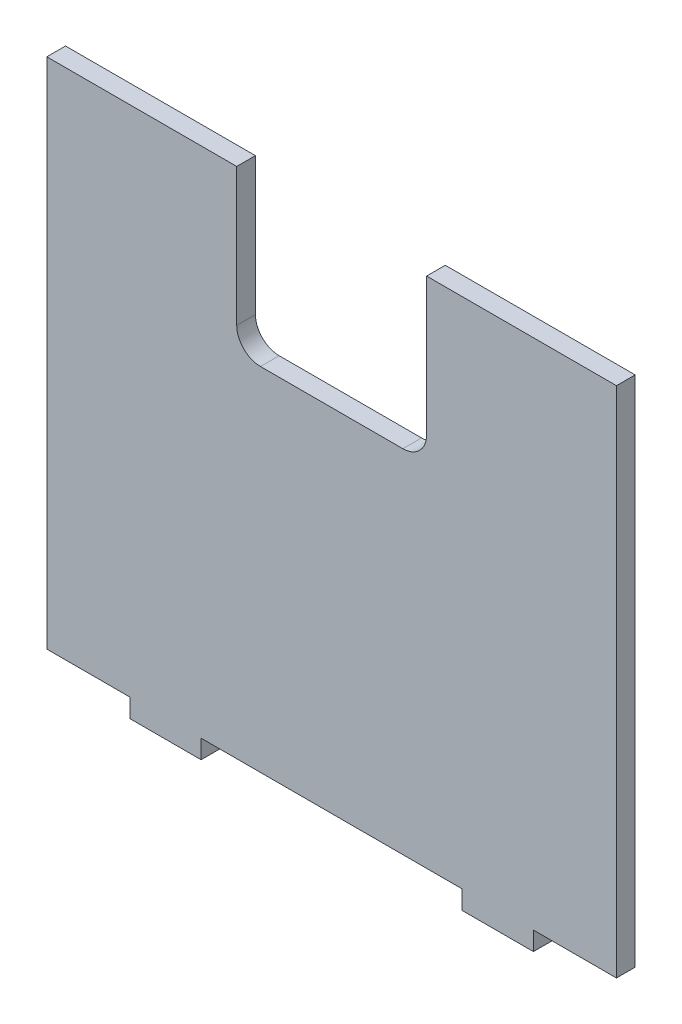
ISO-10303-21;
HEADER;
FILE_DESCRIPTION(('STEP AP214'),'2;1');
FILE_NAME('part.step','',(''),(''),'','','');
FILE_SCHEMA(('AUTOMOTIVE_DESIGN { 1 0 10303 214 1 1 1 1 }'));
ENDSEC;
DATA;
#1=APPLICATION_CONTEXT('core data for automotive mechanical design processes');
#2=APPLICATION_PROTOCOL_DEFINITION('international standard','automotive_design',2000,#1);
#3=PRODUCT_CONTEXT('',#1,'mechanical');
#4=PRODUCT('Part','Part','',(#3));
#5=PRODUCT_RELATED_PRODUCT_CATEGORY('part','',(#4));
#6=PRODUCT_DEFINITION_FORMATION('','',#4);
#7=PRODUCT_DEFINITION_CONTEXT('part definition',#1,'design');
#8=PRODUCT_DEFINITION('design','',#6,#7);
#9=PRODUCT_DEFINITION_SHAPE('','',#8);
#10=(LENGTH_UNIT() NAMED_UNIT(*) SI_UNIT(.MILLI.,.METRE.));
#11=(NAMED_UNIT(*) PLANE_ANGLE_UNIT() SI_UNIT($,.RADIAN.));
#12=(NAMED_UNIT(*) SI_UNIT($,.STERADIAN.) SOLID_ANGLE_UNIT());
#13=UNCERTAINTY_MEASURE_WITH_UNIT(LENGTH_MEASURE(1.E-05),#10,'distance_accuracy_value','');
#14=(GEOMETRIC_REPRESENTATION_CONTEXT(3) GLOBAL_UNCERTAINTY_ASSIGNED_CONTEXT((#13)) GLOBAL_UNIT_ASSIGNED_CONTEXT((#10,
#11,#12)) REPRESENTATION_CONTEXT('',''));
#15=CARTESIAN_POINT('',(0.,0.,0.));
#16=DIRECTION('',(0.,0.,1.));
#17=DIRECTION('',(1.,0.,0.));
#18=AXIS2_PLACEMENT_3D('',#15,#16,#17);
#19=CARTESIAN_POINT('',(-76.2,5.,0.));
#20=DIRECTION('',(0.,0.,1.));
#21=DIRECTION('',(1.,0.,0.));
#22=AXIS2_PLACEMENT_3D('',#19,#20,#21);
#23=PLANE('',#22);
#24=DIRECTION('',(1.,0.,0.));
#25=VECTOR('',#24,1.);
#26=CARTESIAN_POINT('',(-25.3999999999998,99.06,0.));
#27=LINE('',#26,#25);
#28=CARTESIAN_POINT('',(19.0500000000001,99.06,0.));
#29=VERTEX_POINT('',#28);
#30=CARTESIAN_POINT('',(-19.0499999999998,99.06,0.));
#31=VERTEX_POINT('',#30);
#32=EDGE_CURVE('E139',#29,#31,#27,.F.);
#33=ORIENTED_EDGE('',*,*,#32,.T.);
#34=CARTESIAN_POINT('',(-19.0499999999998,105.41,0.));
#35=DIRECTION('',(0.,0.,-1.));
#36=DIRECTION('',(-1.,0.,0.));
#37=AXIS2_PLACEMENT_3D('',#34,#35,#36);
#38=CIRCLE('',#37,6.35);
#39=CARTESIAN_POINT('',(-25.3999999999998,105.41,0.));
#40=VERTEX_POINT('',#39);
#41=EDGE_CURVE('E341',#31,#40,#38,.T.);
#42=ORIENTED_EDGE('',*,*,#41,.T.);
#43=DIRECTION('',(0.,-1.,0.));
#44=VECTOR('',#43,1.);
#45=CARTESIAN_POINT('',(-25.3999999999998,142.24,0.));
#46=LINE('',#45,#44);
#47=CARTESIAN_POINT('',(-25.3999999999998,142.24,0.));
#48=VERTEX_POINT('',#47);
#49=EDGE_CURVE('E296',#40,#48,#46,.F.);
#50=ORIENTED_EDGE('',*,*,#49,.T.);
#51=DIRECTION('',(1.,0.,0.));
#52=VECTOR('',#51,1.);
#53=CARTESIAN_POINT('',(-76.2000000000001,142.24,0.));
#54=LINE('',#53,#52);
#55=CARTESIAN_POINT('',(-76.2000000000001,142.24,0.));
#56=VERTEX_POINT('',#55);
#57=EDGE_CURVE('E281',#56,#48,#54,.T.);
#58=ORIENTED_EDGE('',*,*,#57,.F.);
#59=DIRECTION('',(0.,-1.,0.));
#60=VECTOR('',#59,1.);
#61=CARTESIAN_POINT('',(-76.2000000000001,142.24,0.));
#62=LINE('',#61,#60);
#63=CARTESIAN_POINT('',(-76.2,5.,0.));
#64=VERTEX_POINT('',#63);
#65=EDGE_CURVE('E289',#64,#56,#62,.F.);
#66=ORIENTED_EDGE('',*,*,#65,.F.);
#67=DIRECTION('',(1.,0.,0.));
#68=VECTOR('',#67,1.);
#69=CARTESIAN_POINT('',(-76.2,5.,0.));
#70=LINE('',#69,#68);
#71=CARTESIAN_POINT('',(-53.9750000000001,5.,0.));
#72=VERTEX_POINT('',#71);
#73=EDGE_CURVE('E276',#72,#64,#70,.F.);
#74=ORIENTED_EDGE('',*,*,#73,.F.);
#75=DIRECTION('',(0.,1.,0.));
#76=VECTOR('',#75,1.);
#77=CARTESIAN_POINT('',(-53.9750000000001,0.,0.));
#78=LINE('',#77,#76);
#79=CARTESIAN_POINT('',(-53.9750000000001,0.,0.));
#80=VERTEX_POINT('',#79);
#81=EDGE_CURVE('E266',#80,#72,#78,.T.);
#82=ORIENTED_EDGE('',*,*,#81,.F.);
#83=DIRECTION('',(1.,0.,0.));
#84=VECTOR('',#83,1.);
#85=CARTESIAN_POINT('',(-34.9250000000001,0.,0.));
#86=LINE('',#85,#84);
#87=CARTESIAN_POINT('',(-34.9250000000001,0.,0.));
#88=VERTEX_POINT('',#87);
#89=EDGE_CURVE('E256',#88,#80,#86,.F.);
#90=ORIENTED_EDGE('',*,*,#89,.F.);
#91=DIRECTION('',(0.,1.,0.));
#92=VECTOR('',#91,1.);
#93=CARTESIAN_POINT('',(-34.9250000000001,0.,0.));
#94=LINE('',#93,#92);
#95=CARTESIAN_POINT('',(-34.9250000000001,5.,0.));
#96=VERTEX_POINT('',#95);
#97=EDGE_CURVE('E246',#96,#88,#94,.F.);
#98=ORIENTED_EDGE('',*,*,#97,.F.);
#99=DIRECTION('',(1.,0.,0.));
#100=VECTOR('',#99,1.);
#101=CARTESIAN_POINT('',(-34.9250000000001,5.,0.));
#102=LINE('',#101,#100);
#103=CARTESIAN_POINT('',(34.9249999999999,5.,0.));
#104=VERTEX_POINT('',#103);
#105=EDGE_CURVE('E236',#104,#96,#102,.F.);
#106=ORIENTED_EDGE('',*,*,#105,.F.);
#107=DIRECTION('',(0.,1.,0.));
#108=VECTOR('',#107,1.);
#109=CARTESIAN_POINT('',(34.9249999999999,0.,0.));
#110=LINE('',#109,#108);
#111=CARTESIAN_POINT('',(34.9249999999999,0.,0.));
#112=VERTEX_POINT('',#111);
#113=EDGE_CURVE('E226',#112,#104,#110,.T.);
#114=ORIENTED_EDGE('',*,*,#113,.F.);
#115=DIRECTION('',(1.,0.,0.));
#116=VECTOR('',#115,1.);
#117=CARTESIAN_POINT('',(53.975,0.,0.));
#118=LINE('',#117,#116);
#119=CARTESIAN_POINT('',(53.975,0.,0.));
#120=VERTEX_POINT('',#119);
#121=EDGE_CURVE('E216',#120,#112,#118,.F.);
#122=ORIENTED_EDGE('',*,*,#121,.F.);
#123=DIRECTION('',(0.,1.,0.));
#124=VECTOR('',#123,1.);
#125=CARTESIAN_POINT('',(53.975,0.,0.));
#126=LINE('',#125,#124);
#127=CARTESIAN_POINT('',(53.975,5.,0.));
#128=VERTEX_POINT('',#127);
#129=EDGE_CURVE('E206',#128,#120,#126,.F.);
#130=ORIENTED_EDGE('',*,*,#129,.F.);
#131=DIRECTION('',(1.,0.,0.));
#132=VECTOR('',#131,1.);
#133=CARTESIAN_POINT('',(53.975,5.,0.));
#134=LINE('',#133,#132);
#135=CARTESIAN_POINT('',(76.1999999999999,5.,0.));
#136=VERTEX_POINT('',#135);
#137=EDGE_CURVE('E196',#136,#128,#134,.F.);
#138=ORIENTED_EDGE('',*,*,#137,.F.);
#139=DIRECTION('',(0.,1.,0.));
#140=VECTOR('',#139,1.);
#141=CARTESIAN_POINT('',(76.1999999999999,142.24,0.));
#142=LINE('',#141,#140);
#143=CARTESIAN_POINT('',(76.1999999999999,142.24,0.));
#144=VERTEX_POINT('',#143);
#145=EDGE_CURVE('E186',#144,#136,#142,.F.);
#146=ORIENTED_EDGE('',*,*,#145,.F.);
#147=DIRECTION('',(1.,0.,0.));
#148=VECTOR('',#147,1.);
#149=CARTESIAN_POINT('',(-76.2000000000001,142.24,0.));
#150=LINE('',#149,#148);
#151=CARTESIAN_POINT('',(25.3999999999998,142.24,0.));
#152=VERTEX_POINT('',#151);
#153=EDGE_CURVE('E176',#152,#144,#150,.T.);
#154=ORIENTED_EDGE('',*,*,#153,.F.);
#155=DIRECTION('',(0.,1.,0.));
#156=VECTOR('',#155,1.);
#157=CARTESIAN_POINT('',(25.3999999999998,142.24,0.));
#158=LINE('',#157,#156);
#159=CARTESIAN_POINT('',(25.4000000000001,105.41,0.));
#160=VERTEX_POINT('',#159);
#161=EDGE_CURVE('E136',#152,#160,#158,.F.);
#162=ORIENTED_EDGE('',*,*,#161,.T.);
#163=CARTESIAN_POINT('',(19.0500000000001,105.41,0.));
#164=DIRECTION('',(0.,0.,-1.));
#165=DIRECTION('',(-1.,0.,0.));
#166=AXIS2_PLACEMENT_3D('',#163,#164,#165);
#167=CIRCLE('',#166,6.35);
#168=EDGE_CURVE('E18',#160,#29,#167,.T.);
#169=ORIENTED_EDGE('',*,*,#168,.T.);
#170=EDGE_LOOP('',(#33,#42,#50,#58,#66,#74,#82,#90,#98,#106,#114,#122,#130,#138,#146,#154,#162,#169));
#171=FACE_BOUND('',#170,.T.);
#172=ADVANCED_FACE('F15',(#171),#23,.T.);
#173=CARTESIAN_POINT('',(-76.2000000000001,142.24,-5.));
#174=DIRECTION('',(-1.,0.,0.));
#175=DIRECTION('',(0.,-1.,0.));
#176=AXIS2_PLACEMENT_3D('',#173,#174,#175);
#177=PLANE('',#176);
#178=DIRECTION('',(0.,1.,0.));
#179=VECTOR('',#178,1.);
#180=CARTESIAN_POINT('',(-76.2000000000001,5.,-5.));
#181=LINE('',#180,#179);
#182=CARTESIAN_POINT('',(-76.2000000000001,142.24,-5.));
#183=VERTEX_POINT('',#182);
#184=CARTESIAN_POINT('',(-76.2,5.,-5.));
#185=VERTEX_POINT('',#184);
#186=EDGE_CURVE('E271',#183,#185,#181,.F.);
#187=ORIENTED_EDGE('',*,*,#186,.T.);
#188=DIRECTION('',(0.,0.,-1.));
#189=VECTOR('',#188,1.);
#190=CARTESIAN_POINT('',(-76.2,5.,-5.));
#191=LINE('',#190,#189);
#192=EDGE_CURVE('E274',#64,#185,#191,.T.);
#193=ORIENTED_EDGE('',*,*,#192,.F.);
#194=ORIENTED_EDGE('',*,*,#65,.T.);
#195=DIRECTION('',(0.,0.,1.));
#196=VECTOR('',#195,1.);
#197=CARTESIAN_POINT('',(-76.2000000000001,142.24,-5.));
#198=LINE('',#197,#196);
#199=EDGE_CURVE('E284',#183,#56,#198,.T.);
#200=ORIENTED_EDGE('',*,*,#199,.F.);
#201=EDGE_LOOP('',(#187,#193,#194,#200));
#202=FACE_BOUND('',#201,.T.);
#203=ADVANCED_FACE('F396',(#202),#177,.T.);
#204=CARTESIAN_POINT('',(-76.2,5.,-5.));
#205=DIRECTION('',(0.,-1.,0.));
#206=DIRECTION('',(0.,0.,-1.));
#207=AXIS2_PLACEMENT_3D('',#204,#205,#206);
#208=PLANE('',#207);
#209=DIRECTION('',(1.,0.,0.));
#210=VECTOR('',#209,1.);
#211=CARTESIAN_POINT('',(-76.2,5.,-5.));
#212=LINE('',#211,#210);
#213=CARTESIAN_POINT('',(-53.9750000000001,5.,-5.));
#214=VERTEX_POINT('',#213);
#215=EDGE_CURVE('E261',#185,#214,#212,.T.);
#216=ORIENTED_EDGE('',*,*,#215,.T.);
#217=DIRECTION('',(0.,0.,1.));
#218=VECTOR('',#217,1.);
#219=CARTESIAN_POINT('',(-53.9750000000001,5.,-5.));
#220=LINE('',#219,#218);
#221=EDGE_CURVE('E264',#72,#214,#220,.F.);
#222=ORIENTED_EDGE('',*,*,#221,.F.);
#223=ORIENTED_EDGE('',*,*,#73,.T.);
#224=ORIENTED_EDGE('',*,*,#192,.T.);
#225=EDGE_LOOP('',(#216,#222,#223,#224));
#226=FACE_BOUND('',#225,.T.);
#227=ADVANCED_FACE('F399',(#226),#208,.T.);
#228=CARTESIAN_POINT('',(-53.9750000000001,0.,-5.));
#229=DIRECTION('',(-1.,0.,0.));
#230=DIRECTION('',(0.,0.,1.));
#231=AXIS2_PLACEMENT_3D('',#228,#229,#230);
#232=PLANE('',#231);
#233=DIRECTION('',(0.,1.,0.));
#234=VECTOR('',#233,1.);
#235=CARTESIAN_POINT('',(-53.9750000000001,5.,-5.));
#236=LINE('',#235,#234);
#237=CARTESIAN_POINT('',(-53.9750000000001,0.,-5.));
#238=VERTEX_POINT('',#237);
#239=EDGE_CURVE('E251',#214,#238,#236,.F.);
#240=ORIENTED_EDGE('',*,*,#239,.T.);
#241=DIRECTION('',(0.,0.,-1.));
#242=VECTOR('',#241,1.);
#243=CARTESIAN_POINT('',(-53.9750000000001,0.,-5.));
#244=LINE('',#243,#242);
#245=EDGE_CURVE('E254',#80,#238,#244,.T.);
#246=ORIENTED_EDGE('',*,*,#245,.F.);
#247=ORIENTED_EDGE('',*,*,#81,.T.);
#248=ORIENTED_EDGE('',*,*,#221,.T.);
#249=EDGE_LOOP('',(#240,#246,#247,#248));
#250=FACE_BOUND('',#249,.T.);
#251=ADVANCED_FACE('F405',(#250),#232,.T.);
#252=CARTESIAN_POINT('',(-34.9250000000001,0.,-5.));
#253=DIRECTION('',(0.,-1.,0.));
#254=DIRECTION('',(0.,0.,-1.));
#255=AXIS2_PLACEMENT_3D('',#252,#253,#254);
#256=PLANE('',#255);
#257=DIRECTION('',(1.,0.,0.));
#258=VECTOR('',#257,1.);
#259=CARTESIAN_POINT('',(-76.2,0.,-5.));
#260=LINE('',#259,#258);
#261=CARTESIAN_POINT('',(-34.9250000000001,0.,-5.));
#262=VERTEX_POINT('',#261);
#263=EDGE_CURVE('E241',#238,#262,#260,.T.);
#264=ORIENTED_EDGE('',*,*,#263,.T.);
#265=DIRECTION('',(0.,0.,-1.));
#266=VECTOR('',#265,1.);
#267=CARTESIAN_POINT('',(-34.9250000000001,0.,-5.));
#268=LINE('',#267,#266);
#269=EDGE_CURVE('E244',#88,#262,#268,.T.);
#270=ORIENTED_EDGE('',*,*,#269,.F.);
#271=ORIENTED_EDGE('',*,*,#89,.T.);
#272=ORIENTED_EDGE('',*,*,#245,.T.);
#273=EDGE_LOOP('',(#264,#270,#271,#272));
#274=FACE_BOUND('',#273,.T.);
#275=ADVANCED_FACE('F412',(#274),#256,.T.);
#276=CARTESIAN_POINT('',(-34.9250000000001,0.,-5.));
#277=DIRECTION('',(1.,0.,0.));
#278=DIRECTION('',(0.,0.,-1.));
#279=AXIS2_PLACEMENT_3D('',#276,#277,#278);
#280=PLANE('',#279);
#281=DIRECTION('',(0.,1.,0.));
#282=VECTOR('',#281,1.);
#283=CARTESIAN_POINT('',(-34.9250000000001,5.,-5.));
#284=LINE('',#283,#282);
#285=CARTESIAN_POINT('',(-34.9250000000001,5.,-5.));
#286=VERTEX_POINT('',#285);
#287=EDGE_CURVE('E231',#262,#286,#284,.T.);
#288=ORIENTED_EDGE('',*,*,#287,.T.);
#289=DIRECTION('',(0.,0.,-1.));
#290=VECTOR('',#289,1.);
#291=CARTESIAN_POINT('',(-34.9250000000001,5.,-5.));
#292=LINE('',#291,#290);
#293=EDGE_CURVE('E234',#96,#286,#292,.T.);
#294=ORIENTED_EDGE('',*,*,#293,.F.);
#295=ORIENTED_EDGE('',*,*,#97,.T.);
#296=ORIENTED_EDGE('',*,*,#269,.T.);
#297=EDGE_LOOP('',(#288,#294,#295,#296));
#298=FACE_BOUND('',#297,.T.);
#299=ADVANCED_FACE('F414',(#298),#280,.T.);
#300=CARTESIAN_POINT('',(-34.9250000000001,5.,-5.));
#301=DIRECTION('',(0.,-1.,0.));
#302=DIRECTION('',(0.,0.,-1.));
#303=AXIS2_PLACEMENT_3D('',#300,#301,#302);
#304=PLANE('',#303);
#305=DIRECTION('',(1.,0.,0.));
#306=VECTOR('',#305,1.);
#307=CARTESIAN_POINT('',(-76.2,5.,-5.));
#308=LINE('',#307,#306);
#309=CARTESIAN_POINT('',(34.9249999999999,5.,-5.));
#310=VERTEX_POINT('',#309);
#311=EDGE_CURVE('E221',#286,#310,#308,.T.);
#312=ORIENTED_EDGE('',*,*,#311,.T.);
#313=DIRECTION('',(0.,0.,1.));
#314=VECTOR('',#313,1.);
#315=CARTESIAN_POINT('',(34.9249999999999,5.,-5.));
#316=LINE('',#315,#314);
#317=EDGE_CURVE('E224',#104,#310,#316,.F.);
#318=ORIENTED_EDGE('',*,*,#317,.F.);
#319=ORIENTED_EDGE('',*,*,#105,.T.);
#320=ORIENTED_EDGE('',*,*,#293,.T.);
#321=EDGE_LOOP('',(#312,#318,#319,#320));
#322=FACE_BOUND('',#321,.T.);
#323=ADVANCED_FACE('F420',(#322),#304,.T.);
#324=CARTESIAN_POINT('',(34.9249999999999,0.,-5.));
#325=DIRECTION('',(-1.,0.,0.));
#326=DIRECTION('',(0.,0.,1.));
#327=AXIS2_PLACEMENT_3D('',#324,#325,#326);
#328=PLANE('',#327);
#329=DIRECTION('',(0.,1.,0.));
#330=VECTOR('',#329,1.);
#331=CARTESIAN_POINT('',(34.9249999999999,5.,-5.));
#332=LINE('',#331,#330);
#333=CARTESIAN_POINT('',(34.9249999999999,0.,-5.));
#334=VERTEX_POINT('',#333);
#335=EDGE_CURVE('E211',#310,#334,#332,.F.);
#336=ORIENTED_EDGE('',*,*,#335,.T.);
#337=DIRECTION('',(0.,0.,-1.));
#338=VECTOR('',#337,1.);
#339=CARTESIAN_POINT('',(34.9249999999999,0.,-5.));
#340=LINE('',#339,#338);
#341=EDGE_CURVE('E214',#112,#334,#340,.T.);
#342=ORIENTED_EDGE('',*,*,#341,.F.);
#343=ORIENTED_EDGE('',*,*,#113,.T.);
#344=ORIENTED_EDGE('',*,*,#317,.T.);
#345=EDGE_LOOP('',(#336,#342,#343,#344));
#346=FACE_BOUND('',#345,.T.);
#347=ADVANCED_FACE('F427',(#346),#328,.T.);
#348=CARTESIAN_POINT('',(53.975,0.,-5.));
#349=DIRECTION('',(0.,-1.,0.));
#350=DIRECTION('',(0.,0.,-1.));
#351=AXIS2_PLACEMENT_3D('',#348,#349,#350);
#352=PLANE('',#351);
#353=DIRECTION('',(1.,0.,0.));
#354=VECTOR('',#353,1.);
#355=CARTESIAN_POINT('',(-76.2,0.,-5.));
#356=LINE('',#355,#354);
#357=CARTESIAN_POINT('',(53.9749999999999,0.,-5.));
#358=VERTEX_POINT('',#357);
#359=EDGE_CURVE('E201',#334,#358,#356,.T.);
#360=ORIENTED_EDGE('',*,*,#359,.T.);
#361=DIRECTION('',(0.,0.,-1.));
#362=VECTOR('',#361,1.);
#363=CARTESIAN_POINT('',(53.975,0.,-5.));
#364=LINE('',#363,#362);
#365=EDGE_CURVE('E204',#120,#358,#364,.T.);
#366=ORIENTED_EDGE('',*,*,#365,.F.);
#367=ORIENTED_EDGE('',*,*,#121,.T.);
#368=ORIENTED_EDGE('',*,*,#341,.T.);
#369=EDGE_LOOP('',(#360,#366,#367,#368));
#370=FACE_BOUND('',#369,.T.);
#371=ADVANCED_FACE('F429',(#370),#352,.T.);
#372=CARTESIAN_POINT('',(53.975,0.,-5.));
#373=DIRECTION('',(1.,0.,0.));
#374=DIRECTION('',(0.,0.,-1.));
#375=AXIS2_PLACEMENT_3D('',#372,#373,#374);
#376=PLANE('',#375);
#377=DIRECTION('',(0.,1.,0.));
#378=VECTOR('',#377,1.);
#379=CARTESIAN_POINT('',(53.9749999999999,5.,-5.));
#380=LINE('',#379,#378);
#381=CARTESIAN_POINT('',(53.9749999999999,5.,-5.));
#382=VERTEX_POINT('',#381);
#383=EDGE_CURVE('E191',#358,#382,#380,.T.);
#384=ORIENTED_EDGE('',*,*,#383,.T.);
#385=DIRECTION('',(0.,0.,-1.));
#386=VECTOR('',#385,1.);
#387=CARTESIAN_POINT('',(53.975,5.,-5.));
#388=LINE('',#387,#386);
#389=EDGE_CURVE('E194',#128,#382,#388,.T.);
#390=ORIENTED_EDGE('',*,*,#389,.F.);
#391=ORIENTED_EDGE('',*,*,#129,.T.);
#392=ORIENTED_EDGE('',*,*,#365,.T.);
#393=EDGE_LOOP('',(#384,#390,#391,#392));
#394=FACE_BOUND('',#393,.T.);
#395=ADVANCED_FACE('F435',(#394),#376,.T.);
#396=CARTESIAN_POINT('',(53.975,5.,-5.));
#397=DIRECTION('',(0.,-1.,0.));
#398=DIRECTION('',(0.,0.,-1.));
#399=AXIS2_PLACEMENT_3D('',#396,#397,#398);
#400=PLANE('',#399);
#401=DIRECTION('',(1.,0.,0.));
#402=VECTOR('',#401,1.);
#403=CARTESIAN_POINT('',(-76.2,5.,-5.));
#404=LINE('',#403,#402);
#405=CARTESIAN_POINT('',(76.1999999999999,5.,-5.));
#406=VERTEX_POINT('',#405);
#407=EDGE_CURVE('E181',#382,#406,#404,.T.);
#408=ORIENTED_EDGE('',*,*,#407,.T.);
#409=DIRECTION('',(0.,0.,1.));
#410=VECTOR('',#409,1.);
#411=CARTESIAN_POINT('',(76.1999999999999,5.,-5.));
#412=LINE('',#411,#410);
#413=EDGE_CURVE('E184',#136,#406,#412,.F.);
#414=ORIENTED_EDGE('',*,*,#413,.F.);
#415=ORIENTED_EDGE('',*,*,#137,.T.);
#416=ORIENTED_EDGE('',*,*,#389,.T.);
#417=EDGE_LOOP('',(#408,#414,#415,#416));
#418=FACE_BOUND('',#417,.T.);
#419=ADVANCED_FACE('F441',(#418),#400,.T.);
#420=CARTESIAN_POINT('',(76.1999999999999,142.24,-5.));
#421=DIRECTION('',(1.,0.,0.));
#422=DIRECTION('',(0.,1.,0.));
#423=AXIS2_PLACEMENT_3D('',#420,#421,#422);
#424=PLANE('',#423);
#425=DIRECTION('',(0.,1.,0.));
#426=VECTOR('',#425,1.);
#427=CARTESIAN_POINT('',(76.1999999999999,5.,-5.));
#428=LINE('',#427,#426);
#429=CARTESIAN_POINT('',(76.1999999999999,142.24,-5.));
#430=VERTEX_POINT('',#429);
#431=EDGE_CURVE('E172',#406,#430,#428,.T.);
#432=ORIENTED_EDGE('',*,*,#431,.T.);
#433=DIRECTION('',(0.,0.,1.));
#434=VECTOR('',#433,1.);
#435=CARTESIAN_POINT('',(76.1999999999999,142.24,-5.));
#436=LINE('',#435,#434);
#437=EDGE_CURVE('E165',#144,#430,#436,.F.);
#438=ORIENTED_EDGE('',*,*,#437,.F.);
#439=ORIENTED_EDGE('',*,*,#145,.T.);
#440=ORIENTED_EDGE('',*,*,#413,.T.);
#441=EDGE_LOOP('',(#432,#438,#439,#440));
#442=FACE_BOUND('',#441,.T.);
#443=ADVANCED_FACE('F443',(#442),#424,.T.);
#444=CARTESIAN_POINT('',(-76.2000000000001,142.24,-5.));
#445=DIRECTION('',(0.,1.,0.));
#446=DIRECTION('',(0.,0.,1.));
#447=AXIS2_PLACEMENT_3D('',#444,#445,#446);
#448=PLANE('',#447);
#449=ORIENTED_EDGE('',*,*,#437,.T.);
#450=DIRECTION('',(1.,0.,0.));
#451=VECTOR('',#450,1.);
#452=CARTESIAN_POINT('',(-76.2,142.24,-5.));
#453=LINE('',#452,#451);
#454=CARTESIAN_POINT('',(25.3999999999998,142.24,-5.));
#455=VERTEX_POINT('',#454);
#456=EDGE_CURVE('E168',#430,#455,#453,.F.);
#457=ORIENTED_EDGE('',*,*,#456,.T.);
#458=DIRECTION('',(0.,0.,1.));
#459=VECTOR('',#458,1.);
#460=CARTESIAN_POINT('',(25.3999999999998,142.24,-5.));
#461=LINE('',#460,#459);
#462=EDGE_CURVE('E162',#455,#152,#461,.T.);
#463=ORIENTED_EDGE('',*,*,#462,.T.);
#464=ORIENTED_EDGE('',*,*,#153,.T.);
#465=EDGE_LOOP('',(#449,#457,#463,#464));
#466=FACE_BOUND('',#465,.T.);
#467=ADVANCED_FACE('F447',(#466),#448,.T.);
#468=CARTESIAN_POINT('',(25.3999999999998,142.24,-5.));
#469=DIRECTION('',(1.,0.,0.));
#470=DIRECTION('',(0.,1.,0.));
#471=AXIS2_PLACEMENT_3D('',#468,#469,#470);
#472=PLANE('',#471);
#473=DIRECTION('',(0.,0.,-1.));
#474=VECTOR('',#473,1.);
#475=CARTESIAN_POINT('',(25.4000000000001,105.41,-5.));
#476=LINE('',#475,#474);
#477=CARTESIAN_POINT('',(25.4,105.41,-5.));
#478=VERTEX_POINT('',#477);
#479=EDGE_CURVE('E145',#478,#160,#476,.F.);
#480=ORIENTED_EDGE('',*,*,#479,.T.);
#481=ORIENTED_EDGE('',*,*,#161,.F.);
#482=ORIENTED_EDGE('',*,*,#462,.F.);
#483=DIRECTION('',(0.,1.,0.));
#484=VECTOR('',#483,1.);
#485=CARTESIAN_POINT('',(25.3999999999998,5.,-5.));
#486=LINE('',#485,#484);
#487=EDGE_CURVE('E171',#455,#478,#486,.F.);
#488=ORIENTED_EDGE('',*,*,#487,.T.);
#489=EDGE_LOOP('',(#480,#481,#482,#488));
#490=FACE_BOUND('',#489,.T.);
#491=ADVANCED_FACE('F449',(#490),#472,.F.);
#492=CARTESIAN_POINT('',(19.0500000000001,105.41,-5.));
#493=DIRECTION('',(0.,0.,-1.));
#494=DIRECTION('',(-1.,0.,0.));
#495=AXIS2_PLACEMENT_3D('',#492,#493,#494);
#496=CYLINDRICAL_SURFACE('',#495,6.35);
#497=DIRECTION('',(0.,0.,-1.));
#498=VECTOR('',#497,1.);
#499=CARTESIAN_POINT('',(19.0500000000001,99.06,-5.));
#500=LINE('',#499,#498);
#501=CARTESIAN_POINT('',(19.0500000000001,99.06,-5.));
#502=VERTEX_POINT('',#501);
#503=EDGE_CURVE('E144',#502,#29,#500,.F.);
#504=ORIENTED_EDGE('',*,*,#503,.T.);
#505=ORIENTED_EDGE('',*,*,#168,.F.);
#506=ORIENTED_EDGE('',*,*,#479,.F.);
#507=CARTESIAN_POINT('',(19.0500000000001,105.41,-5.));
#508=DIRECTION('',(0.,0.,-1.));
#509=DIRECTION('',(-1.,0.,0.));
#510=AXIS2_PLACEMENT_3D('',#507,#508,#509);
#511=CIRCLE('',#510,6.35);
#512=EDGE_CURVE('E156',#478,#502,#511,.T.);
#513=ORIENTED_EDGE('',*,*,#512,.T.);
#514=EDGE_LOOP('',(#504,#505,#506,#513));
#515=FACE_BOUND('',#514,.T.);
#516=ADVANCED_FACE('F154',(#515),#496,.F.);
#517=CARTESIAN_POINT('',(-25.3999999999998,99.06,-5.));
#518=DIRECTION('',(0.,-1.,0.));
#519=DIRECTION('',(0.,0.,-1.));
#520=AXIS2_PLACEMENT_3D('',#517,#518,#519);
#521=PLANE('',#520);
#522=ORIENTED_EDGE('',*,*,#503,.F.);
#523=DIRECTION('',(1.,0.,0.));
#524=VECTOR('',#523,1.);
#525=CARTESIAN_POINT('',(-76.2,99.06,-5.));
#526=LINE('',#525,#524);
#527=CARTESIAN_POINT('',(-19.0499999999998,99.06,-5.));
#528=VERTEX_POINT('',#527);
#529=EDGE_CURVE('E340',#502,#528,#526,.F.);
#530=ORIENTED_EDGE('',*,*,#529,.T.);
#531=DIRECTION('',(0.,0.,-1.));
#532=VECTOR('',#531,1.);
#533=CARTESIAN_POINT('',(-19.0499999999998,99.06,-5.));
#534=LINE('',#533,#532);
#535=EDGE_CURVE('E151',#528,#31,#534,.F.);
#536=ORIENTED_EDGE('',*,*,#535,.T.);
#537=ORIENTED_EDGE('',*,*,#32,.F.);
#538=EDGE_LOOP('',(#522,#530,#536,#537));
#539=FACE_BOUND('',#538,.T.);
#540=ADVANCED_FACE('F148',(#539),#521,.F.);
#541=CARTESIAN_POINT('',(-19.0499999999998,105.41,-5.));
#542=DIRECTION('',(0.,0.,-1.));
#543=DIRECTION('',(-1.,0.,0.));
#544=AXIS2_PLACEMENT_3D('',#541,#542,#543);
#545=CYLINDRICAL_SURFACE('',#544,6.35);
#546=DIRECTION('',(0.,0.,1.));
#547=VECTOR('',#546,1.);
#548=CARTESIAN_POINT('',(-25.3999999999998,105.41,-5.));
#549=LINE('',#548,#547);
#550=CARTESIAN_POINT('',(-25.3999999999998,105.41,-5.));
#551=VERTEX_POINT('',#550);
#552=EDGE_CURVE('E298',#551,#40,#549,.T.);
#553=ORIENTED_EDGE('',*,*,#552,.T.);
#554=ORIENTED_EDGE('',*,*,#41,.F.);
#555=ORIENTED_EDGE('',*,*,#535,.F.);
#556=CARTESIAN_POINT('',(-19.0499999999998,105.41,-5.));
#557=DIRECTION('',(0.,0.,-1.));
#558=DIRECTION('',(-1.,0.,0.));
#559=AXIS2_PLACEMENT_3D('',#556,#557,#558);
#560=CIRCLE('',#559,6.35);
#561=EDGE_CURVE('E337',#528,#551,#560,.T.);
#562=ORIENTED_EDGE('',*,*,#561,.T.);
#563=EDGE_LOOP('',(#553,#554,#555,#562));
#564=FACE_BOUND('',#563,.T.);
#565=ADVANCED_FACE('F366',(#564),#545,.F.);
#566=CARTESIAN_POINT('',(-25.3999999999998,142.24,-5.));
#567=DIRECTION('',(-1.,0.,0.));
#568=DIRECTION('',(0.,-1.,0.));
#569=AXIS2_PLACEMENT_3D('',#566,#567,#568);
#570=PLANE('',#569);
#571=ORIENTED_EDGE('',*,*,#552,.F.);
#572=DIRECTION('',(0.,1.,0.));
#573=VECTOR('',#572,1.);
#574=CARTESIAN_POINT('',(-25.3999999999998,5.,-5.));
#575=LINE('',#574,#573);
#576=CARTESIAN_POINT('',(-25.3999999999998,142.24,-5.));
#577=VERTEX_POINT('',#576);
#578=EDGE_CURVE('E24',#551,#577,#575,.T.);
#579=ORIENTED_EDGE('',*,*,#578,.T.);
#580=DIRECTION('',(0.,0.,1.));
#581=VECTOR('',#580,1.);
#582=CARTESIAN_POINT('',(-25.3999999999998,142.24,-5.));
#583=LINE('',#582,#581);
#584=EDGE_CURVE('E32',#48,#577,#583,.F.);
#585=ORIENTED_EDGE('',*,*,#584,.F.);
#586=ORIENTED_EDGE('',*,*,#49,.F.);
#587=EDGE_LOOP('',(#571,#579,#585,#586));
#588=FACE_BOUND('',#587,.T.);
#589=ADVANCED_FACE('F361',(#588),#570,.F.);
#590=CARTESIAN_POINT('',(-76.2000000000001,142.24,-5.));
#591=DIRECTION('',(0.,1.,0.));
#592=DIRECTION('',(0.,0.,1.));
#593=AXIS2_PLACEMENT_3D('',#590,#591,#592);
#594=PLANE('',#593);
#595=ORIENTED_EDGE('',*,*,#199,.T.);
#596=ORIENTED_EDGE('',*,*,#57,.T.);
#597=ORIENTED_EDGE('',*,*,#584,.T.);
#598=DIRECTION('',(1.,0.,0.));
#599=VECTOR('',#598,1.);
#600=CARTESIAN_POINT('',(-76.2,142.24,-5.));
#601=LINE('',#600,#599);
#602=EDGE_CURVE('E10',#577,#183,#601,.F.);
#603=ORIENTED_EDGE('',*,*,#602,.T.);
#604=EDGE_LOOP('',(#595,#596,#597,#603));
#605=FACE_BOUND('',#604,.T.);
#606=ADVANCED_FACE('F375',(#605),#594,.T.);
#607=CARTESIAN_POINT('',(-76.2,5.,-5.));
#608=DIRECTION('',(0.,0.,1.));
#609=DIRECTION('',(1.,0.,0.));
#610=AXIS2_PLACEMENT_3D('',#607,#608,#609);
#611=PLANE('',#610);
#612=ORIENTED_EDGE('',*,*,#578,.F.);
#613=ORIENTED_EDGE('',*,*,#561,.F.);
#614=ORIENTED_EDGE('',*,*,#529,.F.);
#615=ORIENTED_EDGE('',*,*,#512,.F.);
#616=ORIENTED_EDGE('',*,*,#487,.F.);
#617=ORIENTED_EDGE('',*,*,#456,.F.);
#618=ORIENTED_EDGE('',*,*,#431,.F.);
#619=ORIENTED_EDGE('',*,*,#407,.F.);
#620=ORIENTED_EDGE('',*,*,#383,.F.);
#621=ORIENTED_EDGE('',*,*,#359,.F.);
#622=ORIENTED_EDGE('',*,*,#335,.F.);
#623=ORIENTED_EDGE('',*,*,#311,.F.);
#624=ORIENTED_EDGE('',*,*,#287,.F.);
#625=ORIENTED_EDGE('',*,*,#263,.F.);
#626=ORIENTED_EDGE('',*,*,#239,.F.);
#627=ORIENTED_EDGE('',*,*,#215,.F.);
#628=ORIENTED_EDGE('',*,*,#186,.F.);
#629=ORIENTED_EDGE('',*,*,#602,.F.);
#630=EDGE_LOOP('',(#612,#613,#614,#615,#616,#617,#618,#619,#620,#621,#622,#623,#624,#625,#626,
#627,#628,#629));
#631=FACE_BOUND('',#630,.T.);
#632=ADVANCED_FACE('F364',(#631),#611,.F.);
#633=CLOSED_SHELL('',(#172,#203,#227,#251,#275,#299,#323,#347,#371,#395,#419,#443,#467,#491,
#516,#540,#565,#589,#606,#632));
#634=MANIFOLD_SOLID_BREP('B1',#633);
#635=ADVANCED_BREP_SHAPE_REPRESENTATION('',(#18,#634),#14);
#636=SHAPE_DEFINITION_REPRESENTATION(#9,#635);
ENDSEC;
END-ISO-10303-21;
